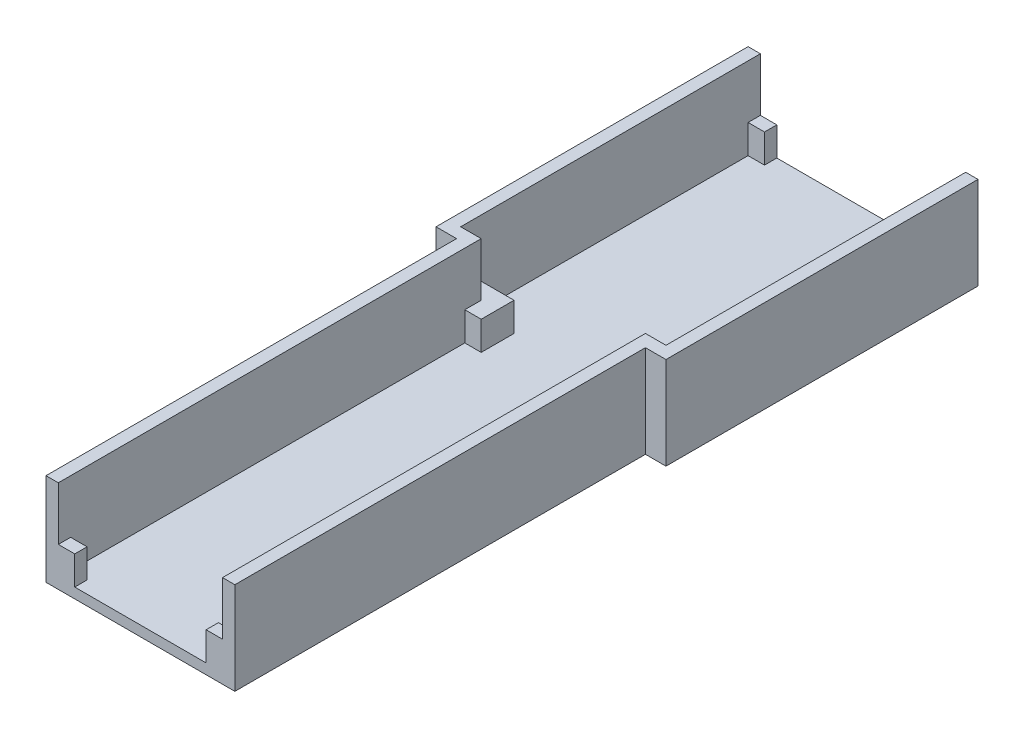
ISO-10303-21;
HEADER;
FILE_DESCRIPTION(('STEP AP214'),'2;1');
FILE_NAME('part.step','',(''),(''),'','','');
FILE_SCHEMA(('AUTOMOTIVE_DESIGN { 1 0 10303 214 1 1 1 1 }'));
ENDSEC;
DATA;
#1=APPLICATION_CONTEXT('core data for automotive mechanical design processes');
#2=APPLICATION_PROTOCOL_DEFINITION('international standard','automotive_design',2000,#1);
#3=PRODUCT_CONTEXT('',#1,'mechanical');
#4=PRODUCT('Part','Part','',(#3));
#5=PRODUCT_RELATED_PRODUCT_CATEGORY('part','',(#4));
#6=PRODUCT_DEFINITION_FORMATION('','',#4);
#7=PRODUCT_DEFINITION_CONTEXT('part definition',#1,'design');
#8=PRODUCT_DEFINITION('design','',#6,#7);
#9=PRODUCT_DEFINITION_SHAPE('','',#8);
#10=(LENGTH_UNIT() NAMED_UNIT(*) SI_UNIT(.MILLI.,.METRE.));
#11=(NAMED_UNIT(*) PLANE_ANGLE_UNIT() SI_UNIT($,.RADIAN.));
#12=(NAMED_UNIT(*) SI_UNIT($,.STERADIAN.) SOLID_ANGLE_UNIT());
#13=UNCERTAINTY_MEASURE_WITH_UNIT(LENGTH_MEASURE(1.E-05),#10,'distance_accuracy_value','');
#14=(GEOMETRIC_REPRESENTATION_CONTEXT(3) GLOBAL_UNCERTAINTY_ASSIGNED_CONTEXT((#13)) GLOBAL_UNIT_ASSIGNED_CONTEXT((#10,
#11,#12)) REPRESENTATION_CONTEXT('',''));
#15=CARTESIAN_POINT('',(0.,0.,0.));
#16=DIRECTION('',(0.,0.,1.));
#17=DIRECTION('',(1.,0.,0.));
#18=AXIS2_PLACEMENT_3D('',#15,#16,#17);
#19=CARTESIAN_POINT('',(0.,2.5,0.));
#20=DIRECTION('',(0.,1.,0.));
#21=DIRECTION('',(0.,0.,1.));
#22=AXIS2_PLACEMENT_3D('',#19,#20,#21);
#23=PLANE('',#22);
#24=DIRECTION('',(1.,0.,0.));
#25=VECTOR('',#24,1.);
#26=CARTESIAN_POINT('',(0.,2.5,43.1396396396397));
#27=LINE('',#26,#25);
#28=CARTESIAN_POINT('',(65.9954954954955,2.5,43.1396396396397));
#29=VERTEX_POINT('',#28);
#30=CARTESIAN_POINT('',(74.9954954954955,2.5,43.1396396396397));
#31=VERTEX_POINT('',#30);
#32=EDGE_CURVE('E282',#29,#31,#27,.T.);
#33=ORIENTED_EDGE('',*,*,#32,.T.);
#34=DIRECTION('',(0.,0.,1.));
#35=VECTOR('',#34,1.);
#36=CARTESIAN_POINT('',(74.9954954954955,2.5,0.));
#37=LINE('',#36,#35);
#38=CARTESIAN_POINT('',(74.9954954954955,2.5,-22.8603603603604));
#39=VERTEX_POINT('',#38);
#40=EDGE_CURVE('E605',#39,#31,#37,.T.);
#41=ORIENTED_EDGE('',*,*,#40,.F.);
#42=DIRECTION('',(1.,0.,0.));
#43=VECTOR('',#42,1.);
#44=CARTESIAN_POINT('',(0.,2.5,-22.8603603603604));
#45=LINE('',#44,#43);
#46=CARTESIAN_POINT('',(70.9954954954955,2.5,-22.8603603603604));
#47=VERTEX_POINT('',#46);
#48=EDGE_CURVE('E578',#47,#39,#45,.T.);
#49=ORIENTED_EDGE('',*,*,#48,.F.);
#50=DIRECTION('',(0.,0.,-1.));
#51=VECTOR('',#50,1.);
#52=CARTESIAN_POINT('',(70.9954954954955,2.5,-25.8603603603604));
#53=LINE('',#52,#51);
#54=CARTESIAN_POINT('',(70.9954954954955,2.5,-25.8603603603604));
#55=VERTEX_POINT('',#54);
#56=EDGE_CURVE('E405',#47,#55,#53,.T.);
#57=ORIENTED_EDGE('',*,*,#56,.T.);
#58=DIRECTION('',(-1.,0.,0.));
#59=VECTOR('',#58,1.);
#60=CARTESIAN_POINT('',(28.9954954954955,2.5,-25.8603603603604));
#61=LINE('',#60,#59);
#62=CARTESIAN_POINT('',(28.9954954954955,2.5,-25.8603603603604));
#63=VERTEX_POINT('',#62);
#64=EDGE_CURVE('E409',#55,#63,#61,.T.);
#65=ORIENTED_EDGE('',*,*,#64,.T.);
#66=DIRECTION('',(0.,0.,1.));
#67=VECTOR('',#66,1.);
#68=CARTESIAN_POINT('',(28.9954954954955,2.5,-25.8603603603604));
#69=LINE('',#68,#67);
#70=CARTESIAN_POINT('',(28.9954954954955,2.5,-22.8603603603604));
#71=VERTEX_POINT('',#70);
#72=EDGE_CURVE('E391',#63,#71,#69,.T.);
#73=ORIENTED_EDGE('',*,*,#72,.T.);
#74=CARTESIAN_POINT('',(24.9954954954955,2.5,-22.8603603603604));
#75=VERTEX_POINT('',#74);
#76=EDGE_CURVE('E601',#75,#71,#45,.T.);
#77=ORIENTED_EDGE('',*,*,#76,.F.);
#78=DIRECTION('',(0.,0.,1.));
#79=VECTOR('',#78,1.);
#80=CARTESIAN_POINT('',(24.9954954954955,2.5,0.));
#81=LINE('',#80,#79);
#82=CARTESIAN_POINT('',(24.9954954954955,2.5,43.1396396396397));
#83=VERTEX_POINT('',#82);
#84=EDGE_CURVE('E584',#75,#83,#81,.T.);
#85=ORIENTED_EDGE('',*,*,#84,.T.);
#86=DIRECTION('',(-1.,0.,0.));
#87=VECTOR('',#86,1.);
#88=CARTESIAN_POINT('',(0.,2.5,43.1396396396397));
#89=LINE('',#88,#87);
#90=CARTESIAN_POINT('',(33.9954954954955,2.5,43.1396396396397));
#91=VERTEX_POINT('',#90);
#92=EDGE_CURVE('E65',#91,#83,#89,.T.);
#93=ORIENTED_EDGE('',*,*,#92,.F.);
#94=DIRECTION('',(0.,0.,1.));
#95=VECTOR('',#94,1.);
#96=CARTESIAN_POINT('',(33.9954954954955,2.5,0.));
#97=LINE('',#96,#95);
#98=CARTESIAN_POINT('',(33.9954954954955,2.5,51.1396396396397));
#99=VERTEX_POINT('',#98);
#100=EDGE_CURVE('E288',#91,#99,#97,.T.);
#101=ORIENTED_EDGE('',*,*,#100,.T.);
#102=DIRECTION('',(1.,0.,0.));
#103=VECTOR('',#102,1.);
#104=CARTESIAN_POINT('',(0.,2.5,51.1396396396397));
#105=LINE('',#104,#103);
#106=CARTESIAN_POINT('',(29.9954954954955,2.5,51.1396396396397));
#107=VERTEX_POINT('',#106);
#108=EDGE_CURVE('E335',#107,#99,#105,.T.);
#109=ORIENTED_EDGE('',*,*,#108,.F.);
#110=DIRECTION('',(0.,0.,1.));
#111=VECTOR('',#110,1.);
#112=CARTESIAN_POINT('',(29.9954954954955,2.5,0.));
#113=LINE('',#112,#111);
#114=CARTESIAN_POINT('',(29.9954954954955,2.5,147.13963963964));
#115=VERTEX_POINT('',#114);
#116=EDGE_CURVE('E535',#107,#115,#113,.T.);
#117=ORIENTED_EDGE('',*,*,#116,.T.);
#118=DIRECTION('',(1.,0.,0.));
#119=VECTOR('',#118,1.);
#120=CARTESIAN_POINT('',(0.,2.5,147.13963963964));
#121=LINE('',#120,#119);
#122=CARTESIAN_POINT('',(33.9954954954955,2.5,147.13963963964));
#123=VERTEX_POINT('',#122);
#124=EDGE_CURVE('E558',#115,#123,#121,.T.);
#125=ORIENTED_EDGE('',*,*,#124,.T.);
#126=DIRECTION('',(0.,0.,1.));
#127=VECTOR('',#126,1.);
#128=CARTESIAN_POINT('',(33.9954954954955,2.5,147.13963963964));
#129=LINE('',#128,#127);
#130=CARTESIAN_POINT('',(33.9954954954955,2.5,150.13963963964));
#131=VERTEX_POINT('',#130);
#132=EDGE_CURVE('E375',#123,#131,#129,.T.);
#133=ORIENTED_EDGE('',*,*,#132,.T.);
#134=DIRECTION('',(1.,0.,0.));
#135=VECTOR('',#134,1.);
#136=CARTESIAN_POINT('',(33.9954954954955,2.5,150.13963963964));
#137=LINE('',#136,#135);
#138=CARTESIAN_POINT('',(65.9954954954955,2.5,150.13963963964));
#139=VERTEX_POINT('',#138);
#140=EDGE_CURVE('E379',#131,#139,#137,.T.);
#141=ORIENTED_EDGE('',*,*,#140,.T.);
#142=DIRECTION('',(0.,0.,-1.));
#143=VECTOR('',#142,1.);
#144=CARTESIAN_POINT('',(65.9954954954955,2.5,147.13963963964));
#145=LINE('',#144,#143);
#146=CARTESIAN_POINT('',(65.9954954954955,2.5,147.13963963964));
#147=VERTEX_POINT('',#146);
#148=EDGE_CURVE('E383',#139,#147,#145,.T.);
#149=ORIENTED_EDGE('',*,*,#148,.T.);
#150=CARTESIAN_POINT('',(69.9954954954955,2.5,147.13963963964));
#151=VERTEX_POINT('',#150);
#152=EDGE_CURVE('E557',#147,#151,#121,.T.);
#153=ORIENTED_EDGE('',*,*,#152,.T.);
#154=DIRECTION('',(0.,0.,1.));
#155=VECTOR('',#154,1.);
#156=CARTESIAN_POINT('',(69.9954954954955,2.5,0.));
#157=LINE('',#156,#155);
#158=CARTESIAN_POINT('',(69.9954954954955,2.5,51.1396396396397));
#159=VERTEX_POINT('',#158);
#160=EDGE_CURVE('E530',#159,#151,#157,.T.);
#161=ORIENTED_EDGE('',*,*,#160,.F.);
#162=DIRECTION('',(-1.,0.,0.));
#163=VECTOR('',#162,1.);
#164=CARTESIAN_POINT('',(0.,2.5,51.1396396396397));
#165=LINE('',#164,#163);
#166=CARTESIAN_POINT('',(65.9954954954955,2.5,51.1396396396397));
#167=VERTEX_POINT('',#166);
#168=EDGE_CURVE('E296',#159,#167,#165,.T.);
#169=ORIENTED_EDGE('',*,*,#168,.T.);
#170=DIRECTION('',(0.,0.,-1.));
#171=VECTOR('',#170,1.);
#172=CARTESIAN_POINT('',(65.9954954954955,2.5,0.));
#173=LINE('',#172,#171);
#174=EDGE_CURVE('E316',#167,#29,#173,.T.);
#175=ORIENTED_EDGE('',*,*,#174,.T.);
#176=EDGE_LOOP('',(#33,#41,#49,#57,#65,#73,#77,#85,#93,#101,#109,#117,#125,#133,#141,#149,#153,
#161,#169,#175));
#177=FACE_BOUND('',#176,.T.);
#178=ADVANCED_FACE('F41',(#177),#23,.T.);
#179=CARTESIAN_POINT('',(24.9954954954955,22.5,0.));
#180=DIRECTION('',(1.,0.,0.));
#181=DIRECTION('',(0.,0.,-1.));
#182=AXIS2_PLACEMENT_3D('',#179,#180,#181);
#183=PLANE('',#182);
#184=DIRECTION('',(0.,0.,1.));
#185=VECTOR('',#184,1.);
#186=CARTESIAN_POINT('',(24.9954954954955,9.5,0.));
#187=LINE('',#186,#185);
#188=CARTESIAN_POINT('',(24.9954954954955,9.5,43.1396396396397));
#189=VERTEX_POINT('',#188);
#190=CARTESIAN_POINT('',(24.9954954954955,9.5,47.1396396396397));
#191=VERTEX_POINT('',#190);
#192=EDGE_CURVE('E339',#189,#191,#187,.T.);
#193=ORIENTED_EDGE('',*,*,#192,.F.);
#194=DIRECTION('',(0.,-1.,0.));
#195=VECTOR('',#194,1.);
#196=CARTESIAN_POINT('',(24.9954954954955,9.5,43.1396396396397));
#197=LINE('',#196,#195);
#198=EDGE_CURVE('E369',#189,#83,#197,.T.);
#199=ORIENTED_EDGE('',*,*,#198,.T.);
#200=ORIENTED_EDGE('',*,*,#84,.F.);
#201=DIRECTION('',(0.,-1.,0.));
#202=VECTOR('',#201,1.);
#203=CARTESIAN_POINT('',(24.9954954954955,22.5,-22.8603603603604));
#204=LINE('',#203,#202);
#205=CARTESIAN_POINT('',(24.9954954954955,9.5,-22.8603603603604));
#206=VERTEX_POINT('',#205);
#207=EDGE_CURVE('E600',#206,#75,#204,.T.);
#208=ORIENTED_EDGE('',*,*,#207,.F.);
#209=DIRECTION('',(0.,0.,-1.));
#210=VECTOR('',#209,1.);
#211=CARTESIAN_POINT('',(24.9954954954955,9.5,0.));
#212=LINE('',#211,#210);
#213=CARTESIAN_POINT('',(24.9954954954955,9.5,-25.8603603603604));
#214=VERTEX_POINT('',#213);
#215=EDGE_CURVE('E441',#206,#214,#212,.T.);
#216=ORIENTED_EDGE('',*,*,#215,.T.);
#217=DIRECTION('',(0.,1.,0.));
#218=VECTOR('',#217,1.);
#219=CARTESIAN_POINT('',(24.9954954954955,9.5,-25.8603603603604));
#220=LINE('',#219,#218);
#221=CARTESIAN_POINT('',(24.9954954954955,22.5,-25.8603603603604));
#222=VERTEX_POINT('',#221);
#223=EDGE_CURVE('E444',#214,#222,#220,.T.);
#224=ORIENTED_EDGE('',*,*,#223,.T.);
#225=DIRECTION('',(0.,0.,1.));
#226=VECTOR('',#225,1.);
#227=CARTESIAN_POINT('',(24.9954954954955,22.5,0.));
#228=LINE('',#227,#226);
#229=CARTESIAN_POINT('',(24.9954954954955,22.5,47.1396396396397));
#230=VERTEX_POINT('',#229);
#231=EDGE_CURVE('E596',#222,#230,#228,.T.);
#232=ORIENTED_EDGE('',*,*,#231,.T.);
#233=DIRECTION('',(0.,-1.,0.));
#234=VECTOR('',#233,1.);
#235=CARTESIAN_POINT('',(24.9954954954955,22.5,47.1396396396397));
#236=LINE('',#235,#234);
#237=EDGE_CURVE('E613',#230,#191,#236,.T.);
#238=ORIENTED_EDGE('',*,*,#237,.T.);
#239=EDGE_LOOP('',(#193,#199,#200,#208,#216,#224,#232,#238));
#240=FACE_BOUND('',#239,.T.);
#241=ADVANCED_FACE('F739',(#240),#183,.T.);
#242=CARTESIAN_POINT('',(29.9954954954955,22.5,0.));
#243=DIRECTION('',(1.,0.,0.));
#244=DIRECTION('',(0.,0.,-1.));
#245=AXIS2_PLACEMENT_3D('',#242,#243,#244);
#246=PLANE('',#245);
#247=ORIENTED_EDGE('',*,*,#116,.F.);
#248=DIRECTION('',(0.,-1.,0.));
#249=VECTOR('',#248,1.);
#250=CARTESIAN_POINT('',(29.9954954954955,9.5,51.1396396396397));
#251=LINE('',#250,#249);
#252=CARTESIAN_POINT('',(29.9954954954955,9.5,51.1396396396397));
#253=VERTEX_POINT('',#252);
#254=EDGE_CURVE('E365',#253,#107,#251,.T.);
#255=ORIENTED_EDGE('',*,*,#254,.F.);
#256=DIRECTION('',(0.,0.,1.));
#257=VECTOR('',#256,1.);
#258=CARTESIAN_POINT('',(29.9954954954955,9.5,0.));
#259=LINE('',#258,#257);
#260=CARTESIAN_POINT('',(29.9954954954955,9.5,47.1396396396397));
#261=VERTEX_POINT('',#260);
#262=EDGE_CURVE('E347',#261,#253,#259,.T.);
#263=ORIENTED_EDGE('',*,*,#262,.F.);
#264=DIRECTION('',(0.,-1.,0.));
#265=VECTOR('',#264,1.);
#266=CARTESIAN_POINT('',(29.9954954954955,22.5,47.1396396396397));
#267=LINE('',#266,#265);
#268=CARTESIAN_POINT('',(29.9954954954955,22.5,47.1396396396397));
#269=VERTEX_POINT('',#268);
#270=EDGE_CURVE('E554',#269,#261,#267,.T.);
#271=ORIENTED_EDGE('',*,*,#270,.F.);
#272=DIRECTION('',(0.,0.,1.));
#273=VECTOR('',#272,1.);
#274=CARTESIAN_POINT('',(29.9954954954955,22.5,0.));
#275=LINE('',#274,#273);
#276=CARTESIAN_POINT('',(29.9954954954955,22.5,150.13963963964));
#277=VERTEX_POINT('',#276);
#278=EDGE_CURVE('E539',#269,#277,#275,.T.);
#279=ORIENTED_EDGE('',*,*,#278,.T.);
#280=DIRECTION('',(0.,1.,0.));
#281=VECTOR('',#280,1.);
#282=CARTESIAN_POINT('',(29.9954954954955,9.5,150.13963963964));
#283=LINE('',#282,#281);
#284=CARTESIAN_POINT('',(29.9954954954955,9.5,150.13963963964));
#285=VERTEX_POINT('',#284);
#286=EDGE_CURVE('E473',#285,#277,#283,.T.);
#287=ORIENTED_EDGE('',*,*,#286,.F.);
#288=DIRECTION('',(0.,0.,1.));
#289=VECTOR('',#288,1.);
#290=CARTESIAN_POINT('',(29.9954954954955,9.5,0.));
#291=LINE('',#290,#289);
#292=CARTESIAN_POINT('',(29.9954954954955,9.5,147.13963963964));
#293=VERTEX_POINT('',#292);
#294=EDGE_CURVE('E492',#293,#285,#291,.T.);
#295=ORIENTED_EDGE('',*,*,#294,.F.);
#296=DIRECTION('',(0.,-1.,0.));
#297=VECTOR('',#296,1.);
#298=CARTESIAN_POINT('',(29.9954954954955,22.5,147.13963963964));
#299=LINE('',#298,#297);
#300=EDGE_CURVE('E566',#293,#115,#299,.T.);
#301=ORIENTED_EDGE('',*,*,#300,.T.);
#302=EDGE_LOOP('',(#247,#255,#263,#271,#279,#287,#295,#301));
#303=FACE_BOUND('',#302,.T.);
#304=ADVANCED_FACE('F752',(#303),#246,.T.);
#305=CARTESIAN_POINT('',(0.,22.5,147.13963963964));
#306=DIRECTION('',(0.,0.,-1.));
#307=DIRECTION('',(-1.,0.,0.));
#308=AXIS2_PLACEMENT_3D('',#305,#306,#307);
#309=PLANE('',#308);
#310=DIRECTION('',(0.,1.,0.));
#311=VECTOR('',#310,1.);
#312=CARTESIAN_POINT('',(33.9954954954955,2.5,147.13963963964));
#313=LINE('',#312,#311);
#314=CARTESIAN_POINT('',(33.9954954954955,9.5,147.13963963964));
#315=VERTEX_POINT('',#314);
#316=EDGE_CURVE('E388',#123,#315,#313,.T.);
#317=ORIENTED_EDGE('',*,*,#316,.F.);
#318=ORIENTED_EDGE('',*,*,#124,.F.);
#319=ORIENTED_EDGE('',*,*,#300,.F.);
#320=DIRECTION('',(-1.,0.,0.));
#321=VECTOR('',#320,1.);
#322=CARTESIAN_POINT('',(0.,9.5,147.13963963964));
#323=LINE('',#322,#321);
#324=EDGE_CURVE('E489',#315,#293,#323,.T.);
#325=ORIENTED_EDGE('',*,*,#324,.F.);
#326=EDGE_LOOP('',(#317,#318,#319,#325));
#327=FACE_BOUND('',#326,.T.);
#328=ADVANCED_FACE('F955',(#327),#309,.T.);
#329=CARTESIAN_POINT('',(0.,22.5,-22.8603603603604));
#330=DIRECTION('',(0.,0.,-1.));
#331=DIRECTION('',(-1.,0.,0.));
#332=AXIS2_PLACEMENT_3D('',#329,#330,#331);
#333=PLANE('',#332);
#334=ORIENTED_EDGE('',*,*,#76,.T.);
#335=DIRECTION('',(0.,1.,0.));
#336=VECTOR('',#335,1.);
#337=CARTESIAN_POINT('',(28.9954954954955,2.5,-22.8603603603604));
#338=LINE('',#337,#336);
#339=CARTESIAN_POINT('',(28.9954954954955,9.5,-22.8603603603604));
#340=VERTEX_POINT('',#339);
#341=EDGE_CURVE('E413',#71,#340,#338,.T.);
#342=ORIENTED_EDGE('',*,*,#341,.T.);
#343=DIRECTION('',(1.,0.,0.));
#344=VECTOR('',#343,1.);
#345=CARTESIAN_POINT('',(0.,9.5,-22.8603603603604));
#346=LINE('',#345,#344);
#347=EDGE_CURVE('E428',#206,#340,#346,.T.);
#348=ORIENTED_EDGE('',*,*,#347,.F.);
#349=ORIENTED_EDGE('',*,*,#207,.T.);
#350=EDGE_LOOP('',(#334,#342,#348,#349));
#351=FACE_BOUND('',#350,.T.);
#352=ADVANCED_FACE('F735',(#351),#333,.F.);
#353=CARTESIAN_POINT('',(0.,2.5,-25.8603603603604));
#354=DIRECTION('',(0.,0.,-1.));
#355=DIRECTION('',(-1.,0.,0.));
#356=AXIS2_PLACEMENT_3D('',#353,#354,#355);
#357=PLANE('',#356);
#358=DIRECTION('',(0.,1.,0.));
#359=VECTOR('',#358,1.);
#360=CARTESIAN_POINT('',(28.9954954954955,2.5,-25.8603603603604));
#361=LINE('',#360,#359);
#362=CARTESIAN_POINT('',(28.9954954954955,9.5,-25.8603603603604));
#363=VERTEX_POINT('',#362);
#364=EDGE_CURVE('E414',#63,#363,#361,.T.);
#365=ORIENTED_EDGE('',*,*,#364,.F.);
#366=ORIENTED_EDGE('',*,*,#64,.F.);
#367=DIRECTION('',(0.,1.,0.));
#368=VECTOR('',#367,1.);
#369=CARTESIAN_POINT('',(70.9954954954955,2.5,-25.8603603603604));
#370=LINE('',#369,#368);
#371=CARTESIAN_POINT('',(70.9954954954955,9.5,-25.8603603603604));
#372=VERTEX_POINT('',#371);
#373=EDGE_CURVE('E418',#55,#372,#370,.T.);
#374=ORIENTED_EDGE('',*,*,#373,.T.);
#375=DIRECTION('',(-1.,0.,0.));
#376=VECTOR('',#375,1.);
#377=CARTESIAN_POINT('',(0.,9.5,-25.8603603603604));
#378=LINE('',#377,#376);
#379=CARTESIAN_POINT('',(74.9954954954955,9.5,-25.8603603603604));
#380=VERTEX_POINT('',#379);
#381=EDGE_CURVE('E461',#380,#372,#378,.T.);
#382=ORIENTED_EDGE('',*,*,#381,.F.);
#383=DIRECTION('',(0.,1.,0.));
#384=VECTOR('',#383,1.);
#385=CARTESIAN_POINT('',(74.9954954954955,9.5,-25.8603603603604));
#386=LINE('',#385,#384);
#387=CARTESIAN_POINT('',(74.9954954954955,22.5,-25.8603603603604));
#388=VERTEX_POINT('',#387);
#389=EDGE_CURVE('E433',#380,#388,#386,.T.);
#390=ORIENTED_EDGE('',*,*,#389,.T.);
#391=DIRECTION('',(-1.,0.,0.));
#392=VECTOR('',#391,1.);
#393=CARTESIAN_POINT('',(0.,22.5,-25.8603603603604));
#394=LINE('',#393,#392);
#395=CARTESIAN_POINT('',(77.9954954954955,22.5,-25.8603603603604));
#396=VERTEX_POINT('',#395);
#397=EDGE_CURVE('E589',#396,#388,#394,.T.);
#398=ORIENTED_EDGE('',*,*,#397,.F.);
#399=DIRECTION('',(0.,-1.,0.));
#400=VECTOR('',#399,1.);
#401=CARTESIAN_POINT('',(77.9954954954955,2.5,-25.8603603603604));
#402=LINE('',#401,#400);
#403=CARTESIAN_POINT('',(77.9954954954955,0.,-25.8603603603604));
#404=VERTEX_POINT('',#403);
#405=EDGE_CURVE('E11',#396,#404,#402,.T.);
#406=ORIENTED_EDGE('',*,*,#405,.T.);
#407=DIRECTION('',(1.,0.,0.));
#408=VECTOR('',#407,1.);
#409=CARTESIAN_POINT('',(0.,0.,-25.8603603603604));
#410=LINE('',#409,#408);
#411=CARTESIAN_POINT('',(21.9954954954955,0.,-25.8603603603604));
#412=VERTEX_POINT('',#411);
#413=EDGE_CURVE('E631',#412,#404,#410,.T.);
#414=ORIENTED_EDGE('',*,*,#413,.F.);
#415=DIRECTION('',(0.,-1.,0.));
#416=VECTOR('',#415,1.);
#417=CARTESIAN_POINT('',(21.9954954954955,2.5,-25.8603603603604));
#418=LINE('',#417,#416);
#419=CARTESIAN_POINT('',(21.9954954954955,22.5,-25.8603603603604));
#420=VERTEX_POINT('',#419);
#421=EDGE_CURVE('E50',#420,#412,#418,.T.);
#422=ORIENTED_EDGE('',*,*,#421,.F.);
#423=EDGE_CURVE('E588',#222,#420,#394,.T.);
#424=ORIENTED_EDGE('',*,*,#423,.F.);
#425=ORIENTED_EDGE('',*,*,#223,.F.);
#426=DIRECTION('',(-1.,0.,0.));
#427=VECTOR('',#426,1.);
#428=CARTESIAN_POINT('',(0.,9.5,-25.8603603603604));
#429=LINE('',#428,#427);
#430=EDGE_CURVE('E437',#363,#214,#429,.T.);
#431=ORIENTED_EDGE('',*,*,#430,.F.);
#432=EDGE_LOOP('',(#365,#366,#374,#382,#390,#398,#406,#414,#422,#424,#425,#431));
#433=FACE_BOUND('',#432,.T.);
#434=ADVANCED_FACE('F667',(#433),#357,.T.);
#435=CARTESIAN_POINT('',(0.,2.5,150.13963963964));
#436=DIRECTION('',(0.,0.,-1.));
#437=DIRECTION('',(-1.,0.,0.));
#438=AXIS2_PLACEMENT_3D('',#435,#436,#437);
#439=PLANE('',#438);
#440=ORIENTED_EDGE('',*,*,#140,.F.);
#441=DIRECTION('',(0.,1.,0.));
#442=VECTOR('',#441,1.);
#443=CARTESIAN_POINT('',(33.9954954954955,2.5,150.13963963964));
#444=LINE('',#443,#442);
#445=CARTESIAN_POINT('',(33.9954954954955,9.5,150.13963963964));
#446=VERTEX_POINT('',#445);
#447=EDGE_CURVE('E387',#131,#446,#444,.T.);
#448=ORIENTED_EDGE('',*,*,#447,.T.);
#449=DIRECTION('',(1.,0.,0.));
#450=VECTOR('',#449,1.);
#451=CARTESIAN_POINT('',(0.,9.5,150.13963963964));
#452=LINE('',#451,#450);
#453=EDGE_CURVE('E496',#285,#446,#452,.T.);
#454=ORIENTED_EDGE('',*,*,#453,.F.);
#455=ORIENTED_EDGE('',*,*,#286,.T.);
#456=DIRECTION('',(1.,0.,0.));
#457=VECTOR('',#456,1.);
#458=CARTESIAN_POINT('',(0.,22.5,150.13963963964));
#459=LINE('',#458,#457);
#460=CARTESIAN_POINT('',(26.9954954954955,22.5,150.13963963964));
#461=VERTEX_POINT('',#460);
#462=EDGE_CURVE('E546',#461,#277,#459,.T.);
#463=ORIENTED_EDGE('',*,*,#462,.F.);
#464=DIRECTION('',(0.,-1.,0.));
#465=VECTOR('',#464,1.);
#466=CARTESIAN_POINT('',(26.9954954954955,2.5,150.13963963964));
#467=LINE('',#466,#465);
#468=CARTESIAN_POINT('',(26.9954954954955,0.,150.13963963964));
#469=VERTEX_POINT('',#468);
#470=EDGE_CURVE('E649',#461,#469,#467,.T.);
#471=ORIENTED_EDGE('',*,*,#470,.T.);
#472=DIRECTION('',(1.,0.,0.));
#473=VECTOR('',#472,1.);
#474=CARTESIAN_POINT('',(0.,0.,150.13963963964));
#475=LINE('',#474,#473);
#476=CARTESIAN_POINT('',(72.9954954954955,0.,150.13963963964));
#477=VERTEX_POINT('',#476);
#478=EDGE_CURVE('E641',#469,#477,#475,.T.);
#479=ORIENTED_EDGE('',*,*,#478,.T.);
#480=DIRECTION('',(0.,-1.,0.));
#481=VECTOR('',#480,1.);
#482=CARTESIAN_POINT('',(72.9954954954955,2.5,150.13963963964));
#483=LINE('',#482,#481);
#484=CARTESIAN_POINT('',(72.9954954954955,22.5,150.13963963964));
#485=VERTEX_POINT('',#484);
#486=EDGE_CURVE('E645',#485,#477,#483,.T.);
#487=ORIENTED_EDGE('',*,*,#486,.F.);
#488=CARTESIAN_POINT('',(69.9954954954955,22.5,150.13963963964));
#489=VERTEX_POINT('',#488);
#490=EDGE_CURVE('E545',#489,#485,#459,.T.);
#491=ORIENTED_EDGE('',*,*,#490,.F.);
#492=DIRECTION('',(0.,1.,0.));
#493=VECTOR('',#492,1.);
#494=CARTESIAN_POINT('',(69.9954954954955,9.5,150.13963963964));
#495=LINE('',#494,#493);
#496=CARTESIAN_POINT('',(69.9954954954955,9.5,150.13963963964));
#497=VERTEX_POINT('',#496);
#498=EDGE_CURVE('E453',#497,#489,#495,.T.);
#499=ORIENTED_EDGE('',*,*,#498,.F.);
#500=DIRECTION('',(1.,0.,0.));
#501=VECTOR('',#500,1.);
#502=CARTESIAN_POINT('',(0.,9.5,150.13963963964));
#503=LINE('',#502,#501);
#504=CARTESIAN_POINT('',(65.9954954954955,9.5,150.13963963964));
#505=VERTEX_POINT('',#504);
#506=EDGE_CURVE('E477',#505,#497,#503,.T.);
#507=ORIENTED_EDGE('',*,*,#506,.F.);
#508=DIRECTION('',(0.,1.,0.));
#509=VECTOR('',#508,1.);
#510=CARTESIAN_POINT('',(65.9954954954955,2.5,150.13963963964));
#511=LINE('',#510,#509);
#512=EDGE_CURVE('E396',#139,#505,#511,.T.);
#513=ORIENTED_EDGE('',*,*,#512,.F.);
#514=EDGE_LOOP('',(#440,#448,#454,#455,#463,#471,#479,#487,#491,#499,#507,#513));
#515=FACE_BOUND('',#514,.T.);
#516=ADVANCED_FACE('F684',(#515),#439,.F.);
#517=DIRECTION('',(1.,0.,0.));
#518=VECTOR('',#517,1.);
#519=CARTESIAN_POINT('',(0.,9.5,-22.8603603603604));
#520=LINE('',#519,#518);
#521=CARTESIAN_POINT('',(70.9954954954955,9.5,-22.8603603603604));
#522=VERTEX_POINT('',#521);
#523=CARTESIAN_POINT('',(74.9954954954955,9.5,-22.8603603603604));
#524=VERTEX_POINT('',#523);
#525=EDGE_CURVE('E452',#522,#524,#520,.T.);
#526=ORIENTED_EDGE('',*,*,#525,.F.);
#527=DIRECTION('',(0.,1.,0.));
#528=VECTOR('',#527,1.);
#529=CARTESIAN_POINT('',(70.9954954954955,2.5,-22.8603603603604));
#530=LINE('',#529,#528);
#531=EDGE_CURVE('E422',#47,#522,#530,.T.);
#532=ORIENTED_EDGE('',*,*,#531,.F.);
#533=ORIENTED_EDGE('',*,*,#48,.T.);
#534=DIRECTION('',(0.,-1.,0.));
#535=VECTOR('',#534,1.);
#536=CARTESIAN_POINT('',(74.9954954954955,22.5,-22.8603603603604));
#537=LINE('',#536,#535);
#538=EDGE_CURVE('E621',#524,#39,#537,.T.);
#539=ORIENTED_EDGE('',*,*,#538,.F.);
#540=EDGE_LOOP('',(#526,#532,#533,#539));
#541=FACE_BOUND('',#540,.T.);
#542=ADVANCED_FACE('F722',(#541),#333,.F.);
#543=CARTESIAN_POINT('',(0.,22.5,0.));
#544=DIRECTION('',(0.,1.,0.));
#545=DIRECTION('',(0.,0.,1.));
#546=AXIS2_PLACEMENT_3D('',#543,#544,#545);
#547=PLANE('',#546);
#548=ORIENTED_EDGE('',*,*,#231,.F.);
#549=ORIENTED_EDGE('',*,*,#423,.T.);
#550=DIRECTION('',(0.,0.,1.));
#551=VECTOR('',#550,1.);
#552=CARTESIAN_POINT('',(21.9954954954955,22.5,0.));
#553=LINE('',#552,#551);
#554=CARTESIAN_POINT('',(21.9954954954955,22.5,50.1396396396397));
#555=VERTEX_POINT('',#554);
#556=EDGE_CURVE('E593',#420,#555,#553,.T.);
#557=ORIENTED_EDGE('',*,*,#556,.T.);
#558=DIRECTION('',(1.,0.,0.));
#559=VECTOR('',#558,1.);
#560=CARTESIAN_POINT('',(21.9954954954955,22.5,50.1396396396397));
#561=LINE('',#560,#559);
#562=CARTESIAN_POINT('',(26.9954954954955,22.5,50.1396396396397));
#563=VERTEX_POINT('',#562);
#564=EDGE_CURVE('E521',#555,#563,#561,.T.);
#565=ORIENTED_EDGE('',*,*,#564,.T.);
#566=DIRECTION('',(0.,0.,1.));
#567=VECTOR('',#566,1.);
#568=CARTESIAN_POINT('',(26.9954954954955,22.5,0.));
#569=LINE('',#568,#567);
#570=EDGE_CURVE('E542',#563,#461,#569,.T.);
#571=ORIENTED_EDGE('',*,*,#570,.T.);
#572=ORIENTED_EDGE('',*,*,#462,.T.);
#573=ORIENTED_EDGE('',*,*,#278,.F.);
#574=DIRECTION('',(1.,0.,0.));
#575=VECTOR('',#574,1.);
#576=CARTESIAN_POINT('',(0.,22.5,47.1396396396397));
#577=LINE('',#576,#575);
#578=EDGE_CURVE('E536',#230,#269,#577,.T.);
#579=ORIENTED_EDGE('',*,*,#578,.F.);
#580=EDGE_LOOP('',(#548,#549,#557,#565,#571,#572,#573,#579));
#581=FACE_BOUND('',#580,.T.);
#582=ADVANCED_FACE('F695',(#581),#547,.T.);
#583=ORIENTED_EDGE('',*,*,#397,.T.);
#584=DIRECTION('',(0.,0.,1.));
#585=VECTOR('',#584,1.);
#586=CARTESIAN_POINT('',(74.9954954954955,22.5,0.));
#587=LINE('',#586,#585);
#588=CARTESIAN_POINT('',(74.9954954954955,22.5,47.1396396396397));
#589=VERTEX_POINT('',#588);
#590=EDGE_CURVE('E579',#388,#589,#587,.T.);
#591=ORIENTED_EDGE('',*,*,#590,.T.);
#592=CARTESIAN_POINT('',(69.9954954954955,22.5,47.1396396396397));
#593=VERTEX_POINT('',#592);
#594=EDGE_CURVE('E531',#593,#589,#577,.T.);
#595=ORIENTED_EDGE('',*,*,#594,.F.);
#596=DIRECTION('',(0.,0.,1.));
#597=VECTOR('',#596,1.);
#598=CARTESIAN_POINT('',(69.9954954954955,22.5,0.));
#599=LINE('',#598,#597);
#600=EDGE_CURVE('E534',#593,#489,#599,.T.);
#601=ORIENTED_EDGE('',*,*,#600,.T.);
#602=ORIENTED_EDGE('',*,*,#490,.T.);
#603=DIRECTION('',(0.,0.,-1.));
#604=VECTOR('',#603,1.);
#605=CARTESIAN_POINT('',(72.9954954954955,22.5,0.));
#606=LINE('',#605,#604);
#607=CARTESIAN_POINT('',(72.9954954954955,22.5,50.1396396396397));
#608=VERTEX_POINT('',#607);
#609=EDGE_CURVE('E550',#485,#608,#606,.T.);
#610=ORIENTED_EDGE('',*,*,#609,.T.);
#611=DIRECTION('',(-1.,0.,0.));
#612=VECTOR('',#611,1.);
#613=CARTESIAN_POINT('',(77.9954954954955,22.5,50.1396396396397));
#614=LINE('',#613,#612);
#615=CARTESIAN_POINT('',(77.9954954954955,22.5,50.1396396396397));
#616=VERTEX_POINT('',#615);
#617=EDGE_CURVE('E513',#616,#608,#614,.T.);
#618=ORIENTED_EDGE('',*,*,#617,.F.);
#619=DIRECTION('',(0.,0.,-1.));
#620=VECTOR('',#619,1.);
#621=CARTESIAN_POINT('',(77.9954954954955,22.5,0.));
#622=LINE('',#621,#620);
#623=EDGE_CURVE('E583',#616,#396,#622,.T.);
#624=ORIENTED_EDGE('',*,*,#623,.T.);
#625=EDGE_LOOP('',(#583,#591,#595,#601,#602,#610,#618,#624));
#626=FACE_BOUND('',#625,.T.);
#627=ADVANCED_FACE('F942',(#626),#547,.T.);
#628=DIRECTION('',(0.,1.,0.));
#629=VECTOR('',#628,1.);
#630=CARTESIAN_POINT('',(65.9954954954955,2.5,147.13963963964));
#631=LINE('',#630,#629);
#632=CARTESIAN_POINT('',(65.9954954954955,9.5,147.13963963964));
#633=VERTEX_POINT('',#632);
#634=EDGE_CURVE('E392',#147,#633,#631,.T.);
#635=ORIENTED_EDGE('',*,*,#634,.T.);
#636=DIRECTION('',(-1.,0.,0.));
#637=VECTOR('',#636,1.);
#638=CARTESIAN_POINT('',(0.,9.5,147.13963963964));
#639=LINE('',#638,#637);
#640=CARTESIAN_POINT('',(69.9954954954955,9.5,147.13963963964));
#641=VERTEX_POINT('',#640);
#642=EDGE_CURVE('E468',#641,#633,#639,.T.);
#643=ORIENTED_EDGE('',*,*,#642,.F.);
#644=DIRECTION('',(0.,-1.,0.));
#645=VECTOR('',#644,1.);
#646=CARTESIAN_POINT('',(69.9954954954955,22.5,147.13963963964));
#647=LINE('',#646,#645);
#648=EDGE_CURVE('E570',#641,#151,#647,.T.);
#649=ORIENTED_EDGE('',*,*,#648,.T.);
#650=ORIENTED_EDGE('',*,*,#152,.F.);
#651=EDGE_LOOP('',(#635,#643,#649,#650));
#652=FACE_BOUND('',#651,.T.);
#653=ADVANCED_FACE('F709',(#652),#309,.T.);
#654=CARTESIAN_POINT('',(72.9954954954955,2.5,0.));
#655=DIRECTION('',(1.,0.,0.));
#656=DIRECTION('',(0.,0.,-1.));
#657=AXIS2_PLACEMENT_3D('',#654,#655,#656);
#658=PLANE('',#657);
#659=DIRECTION('',(0.,0.,1.));
#660=VECTOR('',#659,1.);
#661=CARTESIAN_POINT('',(72.9954954954955,0.,0.));
#662=LINE('',#661,#660);
#663=CARTESIAN_POINT('',(72.9954954954955,0.,50.1396396396397));
#664=VERTEX_POINT('',#663);
#665=EDGE_CURVE('E625',#664,#477,#662,.T.);
#666=ORIENTED_EDGE('',*,*,#665,.F.);
#667=DIRECTION('',(0.,-1.,0.));
#668=VECTOR('',#667,1.);
#669=CARTESIAN_POINT('',(72.9954954954955,22.5,50.1396396396397));
#670=LINE('',#669,#668);
#671=EDGE_CURVE('E448',#608,#664,#670,.T.);
#672=ORIENTED_EDGE('',*,*,#671,.F.);
#673=ORIENTED_EDGE('',*,*,#609,.F.);
#674=ORIENTED_EDGE('',*,*,#486,.T.);
#675=EDGE_LOOP('',(#666,#672,#673,#674));
#676=FACE_BOUND('',#675,.T.);
#677=ADVANCED_FACE('F43',(#676),#658,.T.);
#678=CARTESIAN_POINT('',(26.9954954954955,2.5,0.));
#679=DIRECTION('',(1.,0.,0.));
#680=DIRECTION('',(0.,0.,-1.));
#681=AXIS2_PLACEMENT_3D('',#678,#679,#680);
#682=PLANE('',#681);
#683=DIRECTION('',(0.,1.,0.));
#684=VECTOR('',#683,1.);
#685=CARTESIAN_POINT('',(26.9954954954955,22.5,50.1396396396397));
#686=LINE('',#685,#684);
#687=CARTESIAN_POINT('',(26.9954954954955,0.,50.1396396396397));
#688=VERTEX_POINT('',#687);
#689=EDGE_CURVE('E516',#688,#563,#686,.T.);
#690=ORIENTED_EDGE('',*,*,#689,.F.);
#691=DIRECTION('',(0.,0.,1.));
#692=VECTOR('',#691,1.);
#693=CARTESIAN_POINT('',(26.9954954954955,0.,0.));
#694=LINE('',#693,#692);
#695=EDGE_CURVE('E638',#688,#469,#694,.T.);
#696=ORIENTED_EDGE('',*,*,#695,.T.);
#697=ORIENTED_EDGE('',*,*,#470,.F.);
#698=ORIENTED_EDGE('',*,*,#570,.F.);
#699=EDGE_LOOP('',(#690,#696,#697,#698));
#700=FACE_BOUND('',#699,.T.);
#701=ADVANCED_FACE('F689',(#700),#682,.F.);
#702=CARTESIAN_POINT('',(77.9954954954955,2.5,0.));
#703=DIRECTION('',(1.,0.,0.));
#704=DIRECTION('',(0.,0.,-1.));
#705=AXIS2_PLACEMENT_3D('',#702,#703,#704);
#706=PLANE('',#705);
#707=DIRECTION('',(0.,0.,1.));
#708=VECTOR('',#707,1.);
#709=CARTESIAN_POINT('',(77.9954954954955,0.,0.));
#710=LINE('',#709,#708);
#711=CARTESIAN_POINT('',(77.9954954954955,0.,50.1396396396397));
#712=VERTEX_POINT('',#711);
#713=EDGE_CURVE('E628',#404,#712,#710,.T.);
#714=ORIENTED_EDGE('',*,*,#713,.F.);
#715=ORIENTED_EDGE('',*,*,#405,.F.);
#716=ORIENTED_EDGE('',*,*,#623,.F.);
#717=DIRECTION('',(0.,-1.,0.));
#718=VECTOR('',#717,1.);
#719=CARTESIAN_POINT('',(77.9954954954955,22.5,50.1396396396397));
#720=LINE('',#719,#718);
#721=EDGE_CURVE('E503',#616,#712,#720,.T.);
#722=ORIENTED_EDGE('',*,*,#721,.T.);
#723=EDGE_LOOP('',(#714,#715,#716,#722));
#724=FACE_BOUND('',#723,.T.);
#725=ADVANCED_FACE('F671',(#724),#706,.T.);
#726=CARTESIAN_POINT('',(21.9954954954955,2.5,0.));
#727=DIRECTION('',(1.,0.,0.));
#728=DIRECTION('',(0.,0.,-1.));
#729=AXIS2_PLACEMENT_3D('',#726,#727,#728);
#730=PLANE('',#729);
#731=DIRECTION('',(0.,0.,1.));
#732=VECTOR('',#731,1.);
#733=CARTESIAN_POINT('',(21.9954954954955,0.,0.));
#734=LINE('',#733,#732);
#735=CARTESIAN_POINT('',(21.9954954954955,0.,50.1396396396397));
#736=VERTEX_POINT('',#735);
#737=EDGE_CURVE('E635',#412,#736,#734,.T.);
#738=ORIENTED_EDGE('',*,*,#737,.T.);
#739=DIRECTION('',(0.,1.,0.));
#740=VECTOR('',#739,1.);
#741=CARTESIAN_POINT('',(21.9954954954955,22.5,50.1396396396397));
#742=LINE('',#741,#740);
#743=EDGE_CURVE('E517',#736,#555,#742,.T.);
#744=ORIENTED_EDGE('',*,*,#743,.T.);
#745=ORIENTED_EDGE('',*,*,#556,.F.);
#746=ORIENTED_EDGE('',*,*,#421,.T.);
#747=EDGE_LOOP('',(#738,#744,#745,#746));
#748=FACE_BOUND('',#747,.T.);
#749=ADVANCED_FACE('F657',(#748),#730,.F.);
#750=CARTESIAN_POINT('',(0.,0.,0.));
#751=DIRECTION('',(0.,1.,0.));
#752=DIRECTION('',(0.,0.,1.));
#753=AXIS2_PLACEMENT_3D('',#750,#751,#752);
#754=PLANE('',#753);
#755=ORIENTED_EDGE('',*,*,#713,.T.);
#756=DIRECTION('',(-1.,0.,0.));
#757=VECTOR('',#756,1.);
#758=CARTESIAN_POINT('',(77.9954954954955,0.,50.1396396396397));
#759=LINE('',#758,#757);
#760=EDGE_CURVE('E507',#712,#664,#759,.T.);
#761=ORIENTED_EDGE('',*,*,#760,.T.);
#762=ORIENTED_EDGE('',*,*,#665,.T.);
#763=ORIENTED_EDGE('',*,*,#478,.F.);
#764=ORIENTED_EDGE('',*,*,#695,.F.);
#765=DIRECTION('',(1.,0.,0.));
#766=VECTOR('',#765,1.);
#767=CARTESIAN_POINT('',(21.9954954954955,0.,50.1396396396397));
#768=LINE('',#767,#766);
#769=EDGE_CURVE('E527',#736,#688,#768,.T.);
#770=ORIENTED_EDGE('',*,*,#769,.F.);
#771=ORIENTED_EDGE('',*,*,#737,.F.);
#772=ORIENTED_EDGE('',*,*,#413,.T.);
#773=EDGE_LOOP('',(#755,#761,#762,#763,#764,#770,#771,#772));
#774=FACE_BOUND('',#773,.T.);
#775=ADVANCED_FACE('F663',(#774),#754,.F.);
#776=CARTESIAN_POINT('',(74.9954954954955,22.5,0.));
#777=DIRECTION('',(1.,0.,0.));
#778=DIRECTION('',(0.,0.,-1.));
#779=AXIS2_PLACEMENT_3D('',#776,#777,#778);
#780=PLANE('',#779);
#781=ORIENTED_EDGE('',*,*,#40,.T.);
#782=DIRECTION('',(0.,-1.,0.));
#783=VECTOR('',#782,1.);
#784=CARTESIAN_POINT('',(74.9954954954955,9.5,43.1396396396397));
#785=LINE('',#784,#783);
#786=CARTESIAN_POINT('',(74.9954954954955,9.5,43.1396396396397));
#787=VERTEX_POINT('',#786);
#788=EDGE_CURVE('E313',#787,#31,#785,.T.);
#789=ORIENTED_EDGE('',*,*,#788,.F.);
#790=DIRECTION('',(0.,0.,-1.));
#791=VECTOR('',#790,1.);
#792=CARTESIAN_POINT('',(74.9954954954955,9.5,0.));
#793=LINE('',#792,#791);
#794=CARTESIAN_POINT('',(74.9954954954955,9.5,47.1396396396397));
#795=VERTEX_POINT('',#794);
#796=EDGE_CURVE('E294',#795,#787,#793,.T.);
#797=ORIENTED_EDGE('',*,*,#796,.F.);
#798=DIRECTION('',(0.,-1.,0.));
#799=VECTOR('',#798,1.);
#800=CARTESIAN_POINT('',(74.9954954954955,22.5,47.1396396396396));
#801=LINE('',#800,#799);
#802=EDGE_CURVE('E617',#589,#795,#801,.T.);
#803=ORIENTED_EDGE('',*,*,#802,.F.);
#804=ORIENTED_EDGE('',*,*,#590,.F.);
#805=ORIENTED_EDGE('',*,*,#389,.F.);
#806=DIRECTION('',(0.,0.,-1.));
#807=VECTOR('',#806,1.);
#808=CARTESIAN_POINT('',(74.9954954954955,9.5,0.));
#809=LINE('',#808,#807);
#810=EDGE_CURVE('E457',#524,#380,#809,.T.);
#811=ORIENTED_EDGE('',*,*,#810,.F.);
#812=ORIENTED_EDGE('',*,*,#538,.T.);
#813=EDGE_LOOP('',(#781,#789,#797,#803,#804,#805,#811,#812));
#814=FACE_BOUND('',#813,.T.);
#815=ADVANCED_FACE('F718',(#814),#780,.F.);
#816=CARTESIAN_POINT('',(0.,22.5,47.1396396396397));
#817=DIRECTION('',(0.,0.,-1.));
#818=DIRECTION('',(-1.,0.,0.));
#819=AXIS2_PLACEMENT_3D('',#816,#817,#818);
#820=PLANE('',#819);
#821=DIRECTION('',(-1.,0.,0.));
#822=VECTOR('',#821,1.);
#823=CARTESIAN_POINT('',(0.,9.5,47.1396396396397));
#824=LINE('',#823,#822);
#825=CARTESIAN_POINT('',(69.9954954954955,9.5,47.1396396396397));
#826=VERTEX_POINT('',#825);
#827=EDGE_CURVE('E307',#795,#826,#824,.T.);
#828=ORIENTED_EDGE('',*,*,#827,.T.);
#829=DIRECTION('',(0.,-1.,0.));
#830=VECTOR('',#829,1.);
#831=CARTESIAN_POINT('',(69.9954954954955,22.5,47.1396396396397));
#832=LINE('',#831,#830);
#833=EDGE_CURVE('E574',#593,#826,#832,.T.);
#834=ORIENTED_EDGE('',*,*,#833,.F.);
#835=ORIENTED_EDGE('',*,*,#594,.T.);
#836=ORIENTED_EDGE('',*,*,#802,.T.);
#837=EDGE_LOOP('',(#828,#834,#835,#836));
#838=FACE_BOUND('',#837,.T.);
#839=ADVANCED_FACE('F767',(#838),#820,.T.);
#840=CARTESIAN_POINT('',(69.9954954954955,22.5,0.));
#841=DIRECTION('',(1.,0.,0.));
#842=DIRECTION('',(0.,0.,-1.));
#843=AXIS2_PLACEMENT_3D('',#840,#841,#842);
#844=PLANE('',#843);
#845=DIRECTION('',(0.,0.,-1.));
#846=VECTOR('',#845,1.);
#847=CARTESIAN_POINT('',(69.9954954954955,9.5,0.));
#848=LINE('',#847,#846);
#849=CARTESIAN_POINT('',(69.9954954954955,9.5,51.1396396396397));
#850=VERTEX_POINT('',#849);
#851=EDGE_CURVE('E302',#850,#826,#848,.T.);
#852=ORIENTED_EDGE('',*,*,#851,.F.);
#853=DIRECTION('',(0.,-1.,0.));
#854=VECTOR('',#853,1.);
#855=CARTESIAN_POINT('',(69.9954954954955,9.5,51.1396396396397));
#856=LINE('',#855,#854);
#857=EDGE_CURVE('E324',#850,#159,#856,.T.);
#858=ORIENTED_EDGE('',*,*,#857,.T.);
#859=ORIENTED_EDGE('',*,*,#160,.T.);
#860=ORIENTED_EDGE('',*,*,#648,.F.);
#861=DIRECTION('',(0.,0.,1.));
#862=VECTOR('',#861,1.);
#863=CARTESIAN_POINT('',(69.9954954954955,9.5,0.));
#864=LINE('',#863,#862);
#865=EDGE_CURVE('E481',#641,#497,#864,.T.);
#866=ORIENTED_EDGE('',*,*,#865,.T.);
#867=ORIENTED_EDGE('',*,*,#498,.T.);
#868=ORIENTED_EDGE('',*,*,#600,.F.);
#869=ORIENTED_EDGE('',*,*,#833,.T.);
#870=EDGE_LOOP('',(#852,#858,#859,#860,#866,#867,#868,#869));
#871=FACE_BOUND('',#870,.T.);
#872=ADVANCED_FACE('F712',(#871),#844,.F.);
#873=DIRECTION('',(1.,0.,0.));
#874=VECTOR('',#873,1.);
#875=CARTESIAN_POINT('',(0.,9.5,47.1396396396397));
#876=LINE('',#875,#874);
#877=EDGE_CURVE('E343',#191,#261,#876,.T.);
#878=ORIENTED_EDGE('',*,*,#877,.F.);
#879=ORIENTED_EDGE('',*,*,#237,.F.);
#880=ORIENTED_EDGE('',*,*,#578,.T.);
#881=ORIENTED_EDGE('',*,*,#270,.T.);
#882=EDGE_LOOP('',(#878,#879,#880,#881));
#883=FACE_BOUND('',#882,.T.);
#884=ADVANCED_FACE('F764',(#883),#820,.T.);
#885=CARTESIAN_POINT('',(21.9954954954955,22.5,50.1396396396397));
#886=DIRECTION('',(0.,0.,-1.));
#887=DIRECTION('',(-1.,0.,0.));
#888=AXIS2_PLACEMENT_3D('',#885,#886,#887);
#889=PLANE('',#888);
#890=ORIENTED_EDGE('',*,*,#689,.T.);
#891=ORIENTED_EDGE('',*,*,#564,.F.);
#892=ORIENTED_EDGE('',*,*,#743,.F.);
#893=ORIENTED_EDGE('',*,*,#769,.T.);
#894=EDGE_LOOP('',(#890,#891,#892,#893));
#895=FACE_BOUND('',#894,.T.);
#896=ADVANCED_FACE('F693',(#895),#889,.F.);
#897=CARTESIAN_POINT('',(77.9954954954955,22.5,50.1396396396397));
#898=DIRECTION('',(0.,0.,-1.));
#899=DIRECTION('',(-1.,0.,0.));
#900=AXIS2_PLACEMENT_3D('',#897,#898,#899);
#901=PLANE('',#900);
#902=ORIENTED_EDGE('',*,*,#671,.T.);
#903=ORIENTED_EDGE('',*,*,#760,.F.);
#904=ORIENTED_EDGE('',*,*,#721,.F.);
#905=ORIENTED_EDGE('',*,*,#617,.T.);
#906=EDGE_LOOP('',(#902,#903,#904,#905));
#907=FACE_BOUND('',#906,.T.);
#908=ADVANCED_FACE('F772',(#907),#901,.F.);
#909=CARTESIAN_POINT('',(0.,9.5,0.));
#910=DIRECTION('',(0.,1.,0.));
#911=DIRECTION('',(0.,0.,1.));
#912=AXIS2_PLACEMENT_3D('',#909,#910,#911);
#913=PLANE('',#912);
#914=DIRECTION('',(0.,0.,1.));
#915=VECTOR('',#914,1.);
#916=CARTESIAN_POINT('',(33.9954954954955,9.5,0.));
#917=LINE('',#916,#915);
#918=EDGE_CURVE('E417',#315,#446,#917,.T.);
#919=ORIENTED_EDGE('',*,*,#918,.F.);
#920=ORIENTED_EDGE('',*,*,#324,.T.);
#921=ORIENTED_EDGE('',*,*,#294,.T.);
#922=ORIENTED_EDGE('',*,*,#453,.T.);
#923=EDGE_LOOP('',(#919,#920,#921,#922));
#924=FACE_BOUND('',#923,.T.);
#925=ADVANCED_FACE('F933',(#924),#913,.T.);
#926=CARTESIAN_POINT('',(0.,9.5,0.));
#927=DIRECTION('',(0.,1.,0.));
#928=DIRECTION('',(0.,0.,1.));
#929=AXIS2_PLACEMENT_3D('',#926,#927,#928);
#930=PLANE('',#929);
#931=ORIENTED_EDGE('',*,*,#642,.T.);
#932=DIRECTION('',(0.,0.,1.));
#933=VECTOR('',#932,1.);
#934=CARTESIAN_POINT('',(65.9954954954955,9.5,0.));
#935=LINE('',#934,#933);
#936=EDGE_CURVE('E472',#633,#505,#935,.T.);
#937=ORIENTED_EDGE('',*,*,#936,.T.);
#938=ORIENTED_EDGE('',*,*,#506,.T.);
#939=ORIENTED_EDGE('',*,*,#865,.F.);
#940=EDGE_LOOP('',(#931,#937,#938,#939));
#941=FACE_BOUND('',#940,.T.);
#942=ADVANCED_FACE('F929',(#941),#930,.T.);
#943=CARTESIAN_POINT('',(0.,9.5,0.));
#944=DIRECTION('',(0.,1.,0.));
#945=DIRECTION('',(0.,0.,1.));
#946=AXIS2_PLACEMENT_3D('',#943,#944,#945);
#947=PLANE('',#946);
#948=DIRECTION('',(0.,0.,-1.));
#949=VECTOR('',#948,1.);
#950=CARTESIAN_POINT('',(70.9954954954955,9.5,0.));
#951=LINE('',#950,#949);
#952=EDGE_CURVE('E449',#522,#372,#951,.T.);
#953=ORIENTED_EDGE('',*,*,#952,.F.);
#954=ORIENTED_EDGE('',*,*,#525,.T.);
#955=ORIENTED_EDGE('',*,*,#810,.T.);
#956=ORIENTED_EDGE('',*,*,#381,.T.);
#957=EDGE_LOOP('',(#953,#954,#955,#956));
#958=FACE_BOUND('',#957,.T.);
#959=ADVANCED_FACE('F926',(#958),#947,.T.);
#960=CARTESIAN_POINT('',(0.,9.5,0.));
#961=DIRECTION('',(0.,1.,0.));
#962=DIRECTION('',(0.,0.,1.));
#963=AXIS2_PLACEMENT_3D('',#960,#961,#962);
#964=PLANE('',#963);
#965=ORIENTED_EDGE('',*,*,#347,.T.);
#966=DIRECTION('',(0.,0.,-1.));
#967=VECTOR('',#966,1.);
#968=CARTESIAN_POINT('',(28.9954954954955,9.5,0.));
#969=LINE('',#968,#967);
#970=EDGE_CURVE('E432',#340,#363,#969,.T.);
#971=ORIENTED_EDGE('',*,*,#970,.T.);
#972=ORIENTED_EDGE('',*,*,#430,.T.);
#973=ORIENTED_EDGE('',*,*,#215,.F.);
#974=EDGE_LOOP('',(#965,#971,#972,#973));
#975=FACE_BOUND('',#974,.T.);
#976=ADVANCED_FACE('F731',(#975),#964,.T.);
#977=CARTESIAN_POINT('',(28.9954954954955,2.5,-25.8603603603604));
#978=DIRECTION('',(-1.,0.,0.));
#979=DIRECTION('',(0.,0.,1.));
#980=AXIS2_PLACEMENT_3D('',#977,#978,#979);
#981=PLANE('',#980);
#982=ORIENTED_EDGE('',*,*,#970,.F.);
#983=ORIENTED_EDGE('',*,*,#341,.F.);
#984=ORIENTED_EDGE('',*,*,#72,.F.);
#985=ORIENTED_EDGE('',*,*,#364,.T.);
#986=EDGE_LOOP('',(#982,#983,#984,#985));
#987=FACE_BOUND('',#986,.T.);
#988=ADVANCED_FACE('F729',(#987),#981,.F.);
#989=CARTESIAN_POINT('',(70.9954954954955,2.5,-25.8603603603604));
#990=DIRECTION('',(1.,0.,0.));
#991=DIRECTION('',(0.,0.,-1.));
#992=AXIS2_PLACEMENT_3D('',#989,#990,#991);
#993=PLANE('',#992);
#994=ORIENTED_EDGE('',*,*,#952,.T.);
#995=ORIENTED_EDGE('',*,*,#373,.F.);
#996=ORIENTED_EDGE('',*,*,#56,.F.);
#997=ORIENTED_EDGE('',*,*,#531,.T.);
#998=EDGE_LOOP('',(#994,#995,#996,#997));
#999=FACE_BOUND('',#998,.T.);
#1000=ADVANCED_FACE('F918',(#999),#993,.F.);
#1001=CARTESIAN_POINT('',(33.9954954954955,2.5,147.13963963964));
#1002=DIRECTION('',(-1.,0.,0.));
#1003=DIRECTION('',(0.,0.,1.));
#1004=AXIS2_PLACEMENT_3D('',#1001,#1002,#1003);
#1005=PLANE('',#1004);
#1006=ORIENTED_EDGE('',*,*,#918,.T.);
#1007=ORIENTED_EDGE('',*,*,#447,.F.);
#1008=ORIENTED_EDGE('',*,*,#132,.F.);
#1009=ORIENTED_EDGE('',*,*,#316,.T.);
#1010=EDGE_LOOP('',(#1006,#1007,#1008,#1009));
#1011=FACE_BOUND('',#1010,.T.);
#1012=ADVANCED_FACE('F914',(#1011),#1005,.F.);
#1013=CARTESIAN_POINT('',(65.9954954954955,2.5,147.13963963964));
#1014=DIRECTION('',(1.,0.,0.));
#1015=DIRECTION('',(0.,0.,-1.));
#1016=AXIS2_PLACEMENT_3D('',#1013,#1014,#1015);
#1017=PLANE('',#1016);
#1018=ORIENTED_EDGE('',*,*,#936,.F.);
#1019=ORIENTED_EDGE('',*,*,#634,.F.);
#1020=ORIENTED_EDGE('',*,*,#148,.F.);
#1021=ORIENTED_EDGE('',*,*,#512,.T.);
#1022=EDGE_LOOP('',(#1018,#1019,#1020,#1021));
#1023=FACE_BOUND('',#1022,.T.);
#1024=ADVANCED_FACE('F845',(#1023),#1017,.F.);
#1025=CARTESIAN_POINT('',(33.9954954954955,9.5,0.));
#1026=DIRECTION('',(1.,0.,0.));
#1027=DIRECTION('',(0.,0.,-1.));
#1028=AXIS2_PLACEMENT_3D('',#1025,#1026,#1027);
#1029=PLANE('',#1028);
#1030=ORIENTED_EDGE('',*,*,#100,.F.);
#1031=DIRECTION('',(0.,-1.,0.));
#1032=VECTOR('',#1031,1.);
#1033=CARTESIAN_POINT('',(33.9954954954955,9.5,43.1396396396397));
#1034=LINE('',#1033,#1032);
#1035=CARTESIAN_POINT('',(33.9954954954955,9.5,43.1396396396397));
#1036=VERTEX_POINT('',#1035);
#1037=EDGE_CURVE('E372',#1036,#91,#1034,.T.);
#1038=ORIENTED_EDGE('',*,*,#1037,.F.);
#1039=DIRECTION('',(0.,0.,1.));
#1040=VECTOR('',#1039,1.);
#1041=CARTESIAN_POINT('',(33.9954954954955,9.5,0.));
#1042=LINE('',#1041,#1040);
#1043=CARTESIAN_POINT('',(33.9954954954955,9.5,51.1396396396397));
#1044=VERTEX_POINT('',#1043);
#1045=EDGE_CURVE('E330',#1036,#1044,#1042,.T.);
#1046=ORIENTED_EDGE('',*,*,#1045,.T.);
#1047=DIRECTION('',(0.,-1.,0.));
#1048=VECTOR('',#1047,1.);
#1049=CARTESIAN_POINT('',(33.9954954954955,9.5,51.1396396396397));
#1050=LINE('',#1049,#1048);
#1051=EDGE_CURVE('E354',#1044,#99,#1050,.T.);
#1052=ORIENTED_EDGE('',*,*,#1051,.T.);
#1053=EDGE_LOOP('',(#1030,#1038,#1046,#1052));
#1054=FACE_BOUND('',#1053,.T.);
#1055=ADVANCED_FACE('F747',(#1054),#1029,.T.);
#1056=CARTESIAN_POINT('',(0.,9.5,43.1396396396397));
#1057=DIRECTION('',(0.,0.,1.));
#1058=DIRECTION('',(1.,0.,0.));
#1059=AXIS2_PLACEMENT_3D('',#1056,#1057,#1058);
#1060=PLANE('',#1059);
#1061=ORIENTED_EDGE('',*,*,#92,.T.);
#1062=ORIENTED_EDGE('',*,*,#198,.F.);
#1063=DIRECTION('',(-1.,0.,0.));
#1064=VECTOR('',#1063,1.);
#1065=CARTESIAN_POINT('',(0.,9.5,43.1396396396397));
#1066=LINE('',#1065,#1064);
#1067=EDGE_CURVE('E334',#1036,#189,#1066,.T.);
#1068=ORIENTED_EDGE('',*,*,#1067,.F.);
#1069=ORIENTED_EDGE('',*,*,#1037,.T.);
#1070=EDGE_LOOP('',(#1061,#1062,#1068,#1069));
#1071=FACE_BOUND('',#1070,.T.);
#1072=ADVANCED_FACE('F742',(#1071),#1060,.F.);
#1073=CARTESIAN_POINT('',(0.,9.5,51.1396396396397));
#1074=DIRECTION('',(0.,0.,-1.));
#1075=DIRECTION('',(-1.,0.,0.));
#1076=AXIS2_PLACEMENT_3D('',#1073,#1074,#1075);
#1077=PLANE('',#1076);
#1078=ORIENTED_EDGE('',*,*,#108,.T.);
#1079=ORIENTED_EDGE('',*,*,#1051,.F.);
#1080=DIRECTION('',(1.,0.,0.));
#1081=VECTOR('',#1080,1.);
#1082=CARTESIAN_POINT('',(0.,9.5,51.1396396396397));
#1083=LINE('',#1082,#1081);
#1084=EDGE_CURVE('E351',#253,#1044,#1083,.T.);
#1085=ORIENTED_EDGE('',*,*,#1084,.F.);
#1086=ORIENTED_EDGE('',*,*,#254,.T.);
#1087=EDGE_LOOP('',(#1078,#1079,#1085,#1086));
#1088=FACE_BOUND('',#1087,.T.);
#1089=ADVANCED_FACE('F758',(#1088),#1077,.F.);
#1090=CARTESIAN_POINT('',(0.,9.5,0.));
#1091=DIRECTION('',(0.,1.,0.));
#1092=DIRECTION('',(0.,0.,1.));
#1093=AXIS2_PLACEMENT_3D('',#1090,#1091,#1092);
#1094=PLANE('',#1093);
#1095=ORIENTED_EDGE('',*,*,#1045,.F.);
#1096=ORIENTED_EDGE('',*,*,#1067,.T.);
#1097=ORIENTED_EDGE('',*,*,#192,.T.);
#1098=ORIENTED_EDGE('',*,*,#877,.T.);
#1099=ORIENTED_EDGE('',*,*,#262,.T.);
#1100=ORIENTED_EDGE('',*,*,#1084,.T.);
#1101=EDGE_LOOP('',(#1095,#1096,#1097,#1098,#1099,#1100));
#1102=FACE_BOUND('',#1101,.T.);
#1103=ADVANCED_FACE('F760',(#1102),#1094,.T.);
#1104=CARTESIAN_POINT('',(0.,9.5,43.1396396396397));
#1105=DIRECTION('',(0.,0.,-1.));
#1106=DIRECTION('',(-1.,0.,0.));
#1107=AXIS2_PLACEMENT_3D('',#1104,#1105,#1106);
#1108=PLANE('',#1107);
#1109=ORIENTED_EDGE('',*,*,#32,.F.);
#1110=DIRECTION('',(0.,-1.,0.));
#1111=VECTOR('',#1110,1.);
#1112=CARTESIAN_POINT('',(65.9954954954955,9.5,43.1396396396397));
#1113=LINE('',#1112,#1111);
#1114=CARTESIAN_POINT('',(65.9954954954955,9.5,43.1396396396397));
#1115=VERTEX_POINT('',#1114);
#1116=EDGE_CURVE('E276',#1115,#29,#1113,.T.);
#1117=ORIENTED_EDGE('',*,*,#1116,.F.);
#1118=DIRECTION('',(1.,0.,0.));
#1119=VECTOR('',#1118,1.);
#1120=CARTESIAN_POINT('',(0.,9.5,43.1396396396397));
#1121=LINE('',#1120,#1119);
#1122=EDGE_CURVE('E279',#1115,#787,#1121,.T.);
#1123=ORIENTED_EDGE('',*,*,#1122,.T.);
#1124=ORIENTED_EDGE('',*,*,#788,.T.);
#1125=EDGE_LOOP('',(#1109,#1117,#1123,#1124));
#1126=FACE_BOUND('',#1125,.T.);
#1127=ADVANCED_FACE('F278',(#1126),#1108,.T.);
#1128=CARTESIAN_POINT('',(65.9954954954955,9.5,0.));
#1129=DIRECTION('',(-1.,0.,0.));
#1130=DIRECTION('',(0.,0.,1.));
#1131=AXIS2_PLACEMENT_3D('',#1128,#1129,#1130);
#1132=PLANE('',#1131);
#1133=ORIENTED_EDGE('',*,*,#174,.F.);
#1134=DIRECTION('',(0.,-1.,0.));
#1135=VECTOR('',#1134,1.);
#1136=CARTESIAN_POINT('',(65.9954954954955,9.5,51.1396396396397));
#1137=LINE('',#1136,#1135);
#1138=CARTESIAN_POINT('',(65.9954954954955,9.5,51.1396396396397));
#1139=VERTEX_POINT('',#1138);
#1140=EDGE_CURVE('E289',#1139,#167,#1137,.T.);
#1141=ORIENTED_EDGE('',*,*,#1140,.F.);
#1142=DIRECTION('',(0.,0.,-1.));
#1143=VECTOR('',#1142,1.);
#1144=CARTESIAN_POINT('',(65.9954954954955,9.5,0.));
#1145=LINE('',#1144,#1143);
#1146=EDGE_CURVE('E292',#1139,#1115,#1145,.T.);
#1147=ORIENTED_EDGE('',*,*,#1146,.T.);
#1148=ORIENTED_EDGE('',*,*,#1116,.T.);
#1149=EDGE_LOOP('',(#1133,#1141,#1147,#1148));
#1150=FACE_BOUND('',#1149,.T.);
#1151=ADVANCED_FACE('F298',(#1150),#1132,.T.);
#1152=CARTESIAN_POINT('',(0.,9.5,51.1396396396397));
#1153=DIRECTION('',(0.,0.,1.));
#1154=DIRECTION('',(1.,0.,0.));
#1155=AXIS2_PLACEMENT_3D('',#1152,#1153,#1154);
#1156=PLANE('',#1155);
#1157=ORIENTED_EDGE('',*,*,#168,.F.);
#1158=ORIENTED_EDGE('',*,*,#857,.F.);
#1159=DIRECTION('',(-1.,0.,0.));
#1160=VECTOR('',#1159,1.);
#1161=CARTESIAN_POINT('',(0.,9.5,51.1396396396397));
#1162=LINE('',#1161,#1160);
#1163=EDGE_CURVE('E57',#850,#1139,#1162,.T.);
#1164=ORIENTED_EDGE('',*,*,#1163,.T.);
#1165=ORIENTED_EDGE('',*,*,#1140,.T.);
#1166=EDGE_LOOP('',(#1157,#1158,#1164,#1165));
#1167=FACE_BOUND('',#1166,.T.);
#1168=ADVANCED_FACE('F714',(#1167),#1156,.T.);
#1169=CARTESIAN_POINT('',(0.,9.5,0.));
#1170=DIRECTION('',(0.,1.,0.));
#1171=DIRECTION('',(0.,0.,1.));
#1172=AXIS2_PLACEMENT_3D('',#1169,#1170,#1171);
#1173=PLANE('',#1172);
#1174=ORIENTED_EDGE('',*,*,#1122,.F.);
#1175=ORIENTED_EDGE('',*,*,#1146,.F.);
#1176=ORIENTED_EDGE('',*,*,#1163,.F.);
#1177=ORIENTED_EDGE('',*,*,#851,.T.);
#1178=ORIENTED_EDGE('',*,*,#827,.F.);
#1179=ORIENTED_EDGE('',*,*,#796,.T.);
#1180=EDGE_LOOP('',(#1174,#1175,#1176,#1177,#1178,#1179));
#1181=FACE_BOUND('',#1180,.T.);
#1182=ADVANCED_FACE('F291',(#1181),#1173,.T.);
#1183=CLOSED_SHELL('',(#178,#241,#304,#328,#352,#434,#516,#542,#582,#627,#653,#677,#701,#725,
#749,#775,#815,#839,#872,#884,#896,#908,#925,#942,#959,#976,#988,#1000,#1012,#1024,#1055,#1072,
#1089,#1103,#1127,#1151,#1168,#1182));
#1184=MANIFOLD_SOLID_BREP('B2',#1183);
#1185=ADVANCED_BREP_SHAPE_REPRESENTATION('',(#18,#1184),#14);
#1186=SHAPE_DEFINITION_REPRESENTATION(#9,#1185);
ENDSEC;
END-ISO-10303-21;
